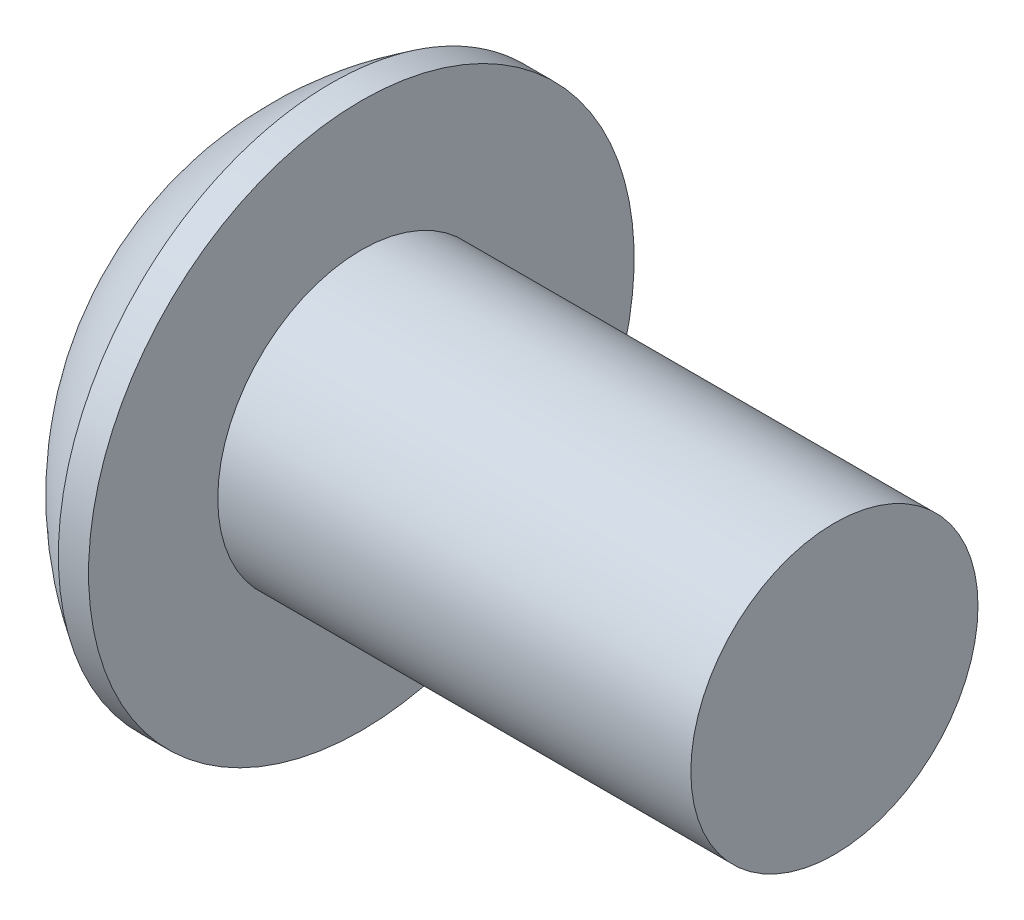
ISO-10303-21;
HEADER;
FILE_DESCRIPTION(('STEP AP214'),'2;1');
FILE_NAME('part.step','',(''),(''),'','','');
FILE_SCHEMA(('AUTOMOTIVE_DESIGN { 1 0 10303 214 1 1 1 1 }'));
ENDSEC;
DATA;
#1=APPLICATION_CONTEXT('core data for automotive mechanical design processes');
#2=APPLICATION_PROTOCOL_DEFINITION('international standard','automotive_design',2000,#1);
#3=PRODUCT_CONTEXT('',#1,'mechanical');
#4=PRODUCT('Part','Part','',(#3));
#5=PRODUCT_RELATED_PRODUCT_CATEGORY('part','',(#4));
#6=PRODUCT_DEFINITION_FORMATION('','',#4);
#7=PRODUCT_DEFINITION_CONTEXT('part definition',#1,'design');
#8=PRODUCT_DEFINITION('design','',#6,#7);
#9=PRODUCT_DEFINITION_SHAPE('','',#8);
#10=(LENGTH_UNIT() NAMED_UNIT(*) SI_UNIT(.MILLI.,.METRE.));
#11=(NAMED_UNIT(*) PLANE_ANGLE_UNIT() SI_UNIT($,.RADIAN.));
#12=(NAMED_UNIT(*) SI_UNIT($,.STERADIAN.) SOLID_ANGLE_UNIT());
#13=UNCERTAINTY_MEASURE_WITH_UNIT(LENGTH_MEASURE(1.E-05),#10,'distance_accuracy_value','');
#14=(GEOMETRIC_REPRESENTATION_CONTEXT(3) GLOBAL_UNCERTAINTY_ASSIGNED_CONTEXT((#13)) GLOBAL_UNIT_ASSIGNED_CONTEXT((#10,
#11,#12)) REPRESENTATION_CONTEXT('',''));
#15=CARTESIAN_POINT('',(0.,0.,0.));
#16=DIRECTION('',(0.,0.,1.));
#17=DIRECTION('',(1.,0.,0.));
#18=AXIS2_PLACEMENT_3D('',#15,#16,#17);
#19=CARTESIAN_POINT('',(-0.533400000000002,0.,0.));
#20=DIRECTION('',(-1.,0.,0.));
#21=DIRECTION('',(0.,0.,1.));
#22=AXIS2_PLACEMENT_3D('',#19,#20,#21);
#23=PLANE('',#22);
#24=DIRECTION('',(0.,0.5,0.866025403784439));
#25=VECTOR('',#24,1.);
#26=CARTESIAN_POINT('',(-0.533400000000002,1.83308710467706,0.));
#27=LINE('',#26,#25);
#28=CARTESIAN_POINT('',(-0.533400000000002,1.83308710467706,0.));
#29=VERTEX_POINT('',#28);
#30=CARTESIAN_POINT('',(-0.533400000000002,0.916543552338531,-1.5875));
#31=VERTEX_POINT('',#30);
#32=EDGE_CURVE('E115',#29,#31,#27,.F.);
#33=ORIENTED_EDGE('',*,*,#32,.T.);
#34=DIRECTION('',(0.,1.,0.));
#35=VECTOR('',#34,1.);
#36=CARTESIAN_POINT('',(-0.533400000000002,0.916543552338531,-1.5875));
#37=LINE('',#36,#35);
#38=CARTESIAN_POINT('',(-0.533400000000002,-0.916543552338531,-1.5875));
#39=VERTEX_POINT('',#38);
#40=EDGE_CURVE('E82',#31,#39,#37,.F.);
#41=ORIENTED_EDGE('',*,*,#40,.T.);
#42=DIRECTION('',(0.,0.5,-0.866025403784439));
#43=VECTOR('',#42,1.);
#44=CARTESIAN_POINT('',(-0.533400000000002,-0.916543552338531,-1.5875));
#45=LINE('',#44,#43);
#46=CARTESIAN_POINT('',(-0.533400000000002,-1.83308710467706,0.));
#47=VERTEX_POINT('',#46);
#48=EDGE_CURVE('E84',#39,#47,#45,.F.);
#49=ORIENTED_EDGE('',*,*,#48,.T.);
#50=DIRECTION('',(0.,-0.5,-0.866025403784439));
#51=VECTOR('',#50,1.);
#52=CARTESIAN_POINT('',(-0.533400000000002,-1.83308710467706,0.));
#53=LINE('',#52,#51);
#54=CARTESIAN_POINT('',(-0.533400000000002,-0.916543552338533,1.5875));
#55=VERTEX_POINT('',#54);
#56=EDGE_CURVE('E85',#47,#55,#53,.F.);
#57=ORIENTED_EDGE('',*,*,#56,.T.);
#58=DIRECTION('',(0.,-1.,0.));
#59=VECTOR('',#58,1.);
#60=CARTESIAN_POINT('',(-0.533400000000002,-0.916543552338532,1.5875));
#61=LINE('',#60,#59);
#62=CARTESIAN_POINT('',(-0.533400000000002,0.916543552338531,1.5875));
#63=VERTEX_POINT('',#62);
#64=EDGE_CURVE('E71',#55,#63,#61,.F.);
#65=ORIENTED_EDGE('',*,*,#64,.T.);
#66=DIRECTION('',(0.,-0.5,0.866025403784439));
#67=VECTOR('',#66,1.);
#68=CARTESIAN_POINT('',(-0.533400000000002,0.916543552338531,1.5875));
#69=LINE('',#68,#67);
#70=EDGE_CURVE('E110',#63,#29,#69,.F.);
#71=ORIENTED_EDGE('',*,*,#70,.T.);
#72=EDGE_LOOP('',(#33,#41,#49,#57,#65,#71));
#73=FACE_BOUND('',#72,.T.);
#74=ADVANCED_FACE('F17',(#73),#23,.T.);
#75=CARTESIAN_POINT('',(-0.533400000000002,-1.83308710467706,0.));
#76=DIRECTION('',(0.,-0.866025403784439,0.5));
#77=DIRECTION('',(0.,-0.5,-0.866025403784439));
#78=AXIS2_PLACEMENT_3D('',#75,#76,#77);
#79=PLANE('',#78);
#80=CARTESIAN_POINT('',(-2.56539999994394,-1.8330871046745,-2.00804498786736E-11));
#81=CARTESIAN_POINT('',(-2.53392818229741,-1.80158505518366,0.0545631502562923));
#82=CARTESIAN_POINT('',(-2.5043050627177,-1.76955629074211,0.110038597579172));
#83=CARTESIAN_POINT('',(-2.45006639539122,-1.70424635317817,0.223158727683824));
#84=CARTESIAN_POINT('',(-2.42548101615987,-1.6709589724711,0.280814162317604));
#85=CARTESIAN_POINT('',(-2.38336609605347,-1.60383660211837,0.397073518091736));
#86=CARTESIAN_POINT('',(-2.36573072948629,-1.57001869730198,0.455647847439699));
#87=CARTESIAN_POINT('',(-2.33856008862263,-1.50163859306838,0.574085662199493));
#88=CARTESIAN_POINT('',(-2.32900454007239,-1.46707848106388,0.633945532106421));
#89=CARTESIAN_POINT('',(-2.32038274183869,-1.40751253669323,0.737116774157155));
#90=CARTESIAN_POINT('',(-2.31910682172836,-1.38258360390154,0.780294952330845));
#91=CARTESIAN_POINT('',(-2.32125913780735,-1.33276652395073,0.866580665890379));
#92=CARTESIAN_POINT('',(-2.32468902284537,-1.30787839414808,0.90968817121394));
#93=CARTESIAN_POINT('',(-2.33605631415915,-1.25834345643267,0.995485200086784));
#94=CARTESIAN_POINT('',(-2.34399762019329,-1.23369687609494,1.03817432946455));
#95=CARTESIAN_POINT('',(-2.36395627681902,-1.18481740842653,1.12283605091316));
#96=CARTESIAN_POINT('',(-2.37597537628367,-1.16058470328902,1.16480832741616));
#97=CARTESIAN_POINT('',(-2.41164383187845,-1.09853862948576,1.27227527965358));
#98=CARTESIAN_POINT('',(-2.43797770752625,-1.06110942924036,1.33710455616529));
#99=CARTESIAN_POINT('',(-2.48243061452926,-1.00607390269188,1.43242888436855));
#100=CARTESIAN_POINT('',(-2.49804835924321,-0.987937988038022,1.46384120999077));
#101=CARTESIAN_POINT('',(-2.53070945051393,-0.951999508520197,1.52608848246242));
#102=CARTESIAN_POINT('',(-2.54775211871235,-0.934196789917587,1.55692369559499));
#103=CARTESIAN_POINT('',(-2.56539999993807,-0.916543552329633,1.58750000001541));
#104=B_SPLINE_CURVE_WITH_KNOTS('',3,(#80,#81,#82,#83,#84,#85,#86,#87,#88,#89,#90,#91,#92,#93,
#94,#95,#96,#97,#98,#99,#100,#101,#102,#103),.UNSPECIFIED.,.F.,.F.,(4,2,2,2,2,2,2,2,2,2,2,4),
(0.,0.211427927732169,0.424087197148228,0.633370156422424,0.842126401515785,0.991537201098734,
1.14100036552056,1.29059292577265,1.44024972414947,1.67781721417335,1.79627069411587,
1.91466809995991),.UNSPECIFIED.);
#105=CARTESIAN_POINT('',(-2.56539999993857,-1.83308710468646,0.));
#106=VERTEX_POINT('',#105);
#107=CARTESIAN_POINT('',(-2.56539999993106,-0.916543552342318,1.5875));
#108=VERTEX_POINT('',#107);
#109=EDGE_CURVE('E20',#106,#108,#104,.T.);
#110=ORIENTED_EDGE('',*,*,#109,.T.);
#111=DIRECTION('',(1.,0.,0.));
#112=VECTOR('',#111,1.);
#113=CARTESIAN_POINT('',(-0.533400000000002,-0.916543552338533,1.5875));
#114=LINE('',#113,#112);
#115=EDGE_CURVE('E90',#108,#55,#114,.T.);
#116=ORIENTED_EDGE('',*,*,#115,.T.);
#117=ORIENTED_EDGE('',*,*,#56,.F.);
#118=DIRECTION('',(1.,0.,0.));
#119=VECTOR('',#118,1.);
#120=CARTESIAN_POINT('',(-0.533400000000002,-1.83308710467706,0.));
#121=LINE('',#120,#119);
#122=EDGE_CURVE('E58',#47,#106,#121,.F.);
#123=ORIENTED_EDGE('',*,*,#122,.T.);
#124=EDGE_LOOP('',(#110,#116,#117,#123));
#125=FACE_BOUND('',#124,.T.);
#126=ADVANCED_FACE('F89',(#125),#79,.F.);
#127=CARTESIAN_POINT('',(-0.533400000000002,-0.916543552338531,-1.5875));
#128=DIRECTION('',(0.,-0.866025403784439,-0.5));
#129=DIRECTION('',(0.,0.5,-0.866025403784439));
#130=AXIS2_PLACEMENT_3D('',#127,#128,#129);
#131=PLANE('',#130);
#132=CARTESIAN_POINT('',(-2.56539999994527,-0.916543552319403,-1.58750000001409));
#133=CARTESIAN_POINT('',(-2.53392818229919,-0.948045601822691,-1.53293684974403));
#134=CARTESIAN_POINT('',(-2.50430506271949,-0.980074366269487,-1.47746140242354));
#135=CARTESIAN_POINT('',(-2.45006639539264,-1.04538430383757,-1.36434127232016));
#136=CARTESIAN_POINT('',(-2.42548101616093,-1.07867168454351,-1.30668583768523));
#137=CARTESIAN_POINT('',(-2.38336609605398,-1.14579405489574,-1.19042648190974));
#138=CARTESIAN_POINT('',(-2.36573072948662,-1.17961195971273,-1.13185215256154));
#139=CARTESIAN_POINT('',(-2.3385600886227,-1.2479920639471,-1.013414337801));
#140=CARTESIAN_POINT('',(-2.32900454007237,-1.28255217595175,-0.953554467893575));
#141=CARTESIAN_POINT('',(-2.32038274183866,-1.34211812032265,-0.850383225842316));
#142=CARTESIAN_POINT('',(-2.31910682172835,-1.36704705311438,-0.807205047668587));
#143=CARTESIAN_POINT('',(-2.32125913780739,-1.41686413306525,-0.720919334108961));
#144=CARTESIAN_POINT('',(-2.32468902284544,-1.44175226286793,-0.67781182878535));
#145=CARTESIAN_POINT('',(-2.33605631415929,-1.49128720058339,-0.592014799912417));
#146=CARTESIAN_POINT('',(-2.34399762019345,-1.51593378092113,-0.54932567053461));
#147=CARTESIAN_POINT('',(-2.36395627681926,-1.56481324858959,-0.464663949085931));
#148=CARTESIAN_POINT('',(-2.37597537628395,-1.58904595372712,-0.422691672582891));
#149=CARTESIAN_POINT('',(-2.41164383187876,-1.65109202753029,-0.315224720345625));
#150=CARTESIAN_POINT('',(-2.43797770752652,-1.6885212277756,-0.250395443834082));
#151=CARTESIAN_POINT('',(-2.48243061452944,-1.74355675432393,-0.15507111563107));
#152=CARTESIAN_POINT('',(-2.49804835924337,-1.76169266897775,-0.123658790008927));
#153=CARTESIAN_POINT('',(-2.53070945051401,-1.79763114849548,-0.0614115175374324));
#154=CARTESIAN_POINT('',(-2.5477521187124,-1.81543386709805,-0.0305763044049344));
#155=CARTESIAN_POINT('',(-2.56539999993807,-1.83308710468596,1.54136844652939E-11));
#156=B_SPLINE_CURVE_WITH_KNOTS('',3,(#132,#133,#134,#135,#136,#137,#138,#139,#140,#141,#142,
#143,#144,#145,#146,#147,#148,#149,#150,#151,#152,#153,#154,#155),.UNSPECIFIED.,.F.,.F.,(4,2,2,
2,2,2,2,2,2,2,2,4),(0.,0.211427927733669,0.424087197151313,0.633370156427101,0.842126401522016,
0.99153720110513,1.14100036552713,1.29059292577937,1.44024972415633,1.67781721417961,
1.79627069412184,1.9146680999656),.UNSPECIFIED.);
#157=CARTESIAN_POINT('',(-2.56539999995198,-0.916543552351339,-1.58750000002218));
#158=VERTEX_POINT('',#157);
#159=EDGE_CURVE('E94',#158,#106,#156,.T.);
#160=ORIENTED_EDGE('',*,*,#159,.T.);
#161=ORIENTED_EDGE('',*,*,#122,.F.);
#162=ORIENTED_EDGE('',*,*,#48,.F.);
#163=DIRECTION('',(-1.,0.,0.));
#164=VECTOR('',#163,1.);
#165=CARTESIAN_POINT('',(-0.533400000000002,-0.916543552338531,-1.5875));
#166=LINE('',#165,#164);
#167=EDGE_CURVE('E96',#39,#158,#166,.T.);
#168=ORIENTED_EDGE('',*,*,#167,.T.);
#169=EDGE_LOOP('',(#160,#161,#162,#168));
#170=FACE_BOUND('',#169,.T.);
#171=ADVANCED_FACE('F92',(#170),#131,.F.);
#172=CARTESIAN_POINT('',(-0.533400000000002,0.916543552338531,-1.5875));
#173=DIRECTION('',(0.,0.,-1.));
#174=DIRECTION('',(-1.,0.,0.));
#175=AXIS2_PLACEMENT_3D('',#172,#173,#174);
#176=PLANE('',#175);
#177=CARTESIAN_POINT('',(-2.56539999994527,0.916543552360294,-1.58749999999048));
#178=CARTESIAN_POINT('',(-2.53392818229821,0.853539453376781,-1.58749999999657));
#179=CARTESIAN_POINT('',(-2.50430506271702,0.789481924500113,-1.58749999999908));
#180=CARTESIAN_POINT('',(-2.45006639538581,0.658862049392287,-1.58750000000093));
#181=CARTESIAN_POINT('',(-2.42548101615122,0.59228728799181,-1.58750000000025));
#182=CARTESIAN_POINT('',(-2.38336609603683,0.458042547310979,-1.58749999999976));
#183=CARTESIAN_POINT('',(-2.36573072946494,0.390406737689213,-1.58749999999994));
#184=CARTESIAN_POINT('',(-2.3385600885904,0.253646529243895,-1.58750000000006));
#185=CARTESIAN_POINT('',(-2.32900454003397,0.184526305245804,-1.58750000000001));
#186=CARTESIAN_POINT('',(-2.32038274178942,0.0653944165301613,-1.58749999999999));
#187=CARTESIAN_POINT('',(-2.31910682167392,0.0155365509618711,-1.5875));
#188=CARTESIAN_POINT('',(-2.3212591377409,-0.0840976089101244,-1.5875));
#189=CARTESIAN_POINT('',(-2.32468902277208,-0.133873868500894,-1.5875));
#190=CARTESIAN_POINT('',(-2.33605631407098,-0.2329437439033,-1.5875));
#191=CARTESIAN_POINT('',(-2.34399762009707,-0.282236904564879,-1.5875));
#192=CARTESIAN_POINT('',(-2.36395627670599,-0.379995839874564,-1.5875));
#193=CARTESIAN_POINT('',(-2.37597537616188,-0.428461250136325,-1.5875));
#194=CARTESIAN_POINT('',(-2.41164383175616,-0.552553397787632,-1.5875));
#195=CARTESIAN_POINT('',(-2.43797770742117,-0.627411798334259,-1.5875));
#196=CARTESIAN_POINT('',(-2.48243061445881,-0.737482851511091,-1.5875));
#197=CARTESIAN_POINT('',(-2.49804835918582,-0.773754680844889,-1.5875));
#198=CARTESIAN_POINT('',(-2.53070945048496,-0.845631639931401,-1.5875));
#199=CARTESIAN_POINT('',(-2.54775211869874,-0.881237077161412,-1.5875));
#200=CARTESIAN_POINT('',(-2.56539999994071,-0.916543552361606,-1.5875));
#201=B_SPLINE_CURVE_WITH_KNOTS('',3,(#177,#178,#179,#180,#181,#182,#183,#184,#185,#186,#187,
#188,#189,#190,#191,#192,#193,#194,#195,#196,#197,#198,#199,#200),.UNSPECIFIED.,.F.,.F.,(4,2,2,
2,2,2,2,2,2,2,2,4),(0.,0.211427927701375,0.424087197086717,0.633370156331471,0.842126401395377,
0.991537200933545,1.14100036531054,1.29059292551773,1.44024972384963,1.677817214047,
1.79627069407681,1.91466810000777),.UNSPECIFIED.);
#202=CARTESIAN_POINT('',(-2.56539999995198,0.916543552337129,-1.58749999999757));
#203=VERTEX_POINT('',#202);
#204=EDGE_CURVE('E198',#203,#158,#201,.T.);
#205=ORIENTED_EDGE('',*,*,#204,.T.);
#206=ORIENTED_EDGE('',*,*,#167,.F.);
#207=ORIENTED_EDGE('',*,*,#40,.F.);
#208=DIRECTION('',(1.,0.,0.));
#209=VECTOR('',#208,1.);
#210=CARTESIAN_POINT('',(-0.533400000000002,0.916543552338531,-1.5875));
#211=LINE('',#210,#209);
#212=EDGE_CURVE('E112',#31,#203,#211,.F.);
#213=ORIENTED_EDGE('',*,*,#212,.T.);
#214=EDGE_LOOP('',(#205,#206,#207,#213));
#215=FACE_BOUND('',#214,.T.);
#216=ADVANCED_FACE('F188',(#215),#176,.F.);
#217=CARTESIAN_POINT('',(-0.533400000000002,1.83308710467706,0.));
#218=DIRECTION('',(0.,0.866025403784439,-0.5));
#219=DIRECTION('',(0.,0.5,0.866025403784439));
#220=AXIS2_PLACEMENT_3D('',#217,#218,#219);
#221=PLANE('',#220);
#222=CARTESIAN_POINT('',(-2.56539999994394,1.8330871046745,2.00800374309997E-11));
#223=CARTESIAN_POINT('',(-2.5339281822974,1.80158505518366,-0.0545631502562965));
#224=CARTESIAN_POINT('',(-2.5043050627177,1.76955629074211,-0.11003859757918));
#225=CARTESIAN_POINT('',(-2.45006639539121,1.70424635317816,-0.22315872768384));
#226=CARTESIAN_POINT('',(-2.42548101615987,1.67095897247109,-0.280814162317626));
#227=CARTESIAN_POINT('',(-2.38336609605347,1.60383660211835,-0.397073518091758));
#228=CARTESIAN_POINT('',(-2.36573072948628,1.57001869730197,-0.455647847439717));
#229=CARTESIAN_POINT('',(-2.33856008862263,1.50163859306837,-0.574085662199503));
#230=CARTESIAN_POINT('',(-2.32900454007239,1.46707848106388,-0.633945532106426));
#231=CARTESIAN_POINT('',(-2.32038274183869,1.40751253669322,-0.737116774157154));
#232=CARTESIAN_POINT('',(-2.31910682172836,1.38258360390154,-0.780294952330843));
#233=CARTESIAN_POINT('',(-2.32125913780735,1.33276652395073,-0.866580665890374));
#234=CARTESIAN_POINT('',(-2.32468902284537,1.30787839414808,-0.909688171213933));
#235=CARTESIAN_POINT('',(-2.33605631415915,1.25834345643267,-0.995485200086777));
#236=CARTESIAN_POINT('',(-2.34399762019328,1.23369687609495,-1.03817432946455));
#237=CARTESIAN_POINT('',(-2.36395627681902,1.18481740842653,-1.12283605091316));
#238=CARTESIAN_POINT('',(-2.37597537628367,1.16058470328902,-1.16480832741616));
#239=CARTESIAN_POINT('',(-2.41164383187872,1.09853862948529,-1.2722752796544));
#240=CARTESIAN_POINT('',(-2.43797770752691,1.06110942923942,-1.33710455616691));
#241=CARTESIAN_POINT('',(-2.48243061453059,1.00607390269029,-1.43242888437131));
#242=CARTESIAN_POINT('',(-2.49804835924479,0.987937988036214,-1.4638412099939));
#243=CARTESIAN_POINT('',(-2.53070945051602,0.951999508517968,-1.52608848246628));
#244=CARTESIAN_POINT('',(-2.54775211871471,0.934196789915152,-1.55692369559921));
#245=CARTESIAN_POINT('',(-2.56539999994071,0.916543552326994,-1.58750000001998));
#246=B_SPLINE_CURVE_WITH_KNOTS('',3,(#222,#223,#224,#225,#226,#227,#228,#229,#230,#231,#232,
#233,#234,#235,#236,#237,#238,#239,#240,#241,#242,#243,#244,#245),.UNSPECIFIED.,.F.,.F.,(4,2,2,
2,2,2,2,2,2,2,2,4),(0.,0.211427927732185,0.424087197148259,0.63337015642244,0.842126401515786,
0.99153720109873,1.14100036552055,1.29059292577265,1.44024972414947,1.67781721417631,
1.7962706941203,1.9146680999658),.UNSPECIFIED.);
#247=CARTESIAN_POINT('',(-2.56539999993857,1.83308710468646,0.));
#248=VERTEX_POINT('',#247);
#249=EDGE_CURVE('E192',#248,#203,#246,.T.);
#250=ORIENTED_EDGE('',*,*,#249,.T.);
#251=ORIENTED_EDGE('',*,*,#212,.F.);
#252=ORIENTED_EDGE('',*,*,#32,.F.);
#253=DIRECTION('',(1.,0.,0.));
#254=VECTOR('',#253,1.);
#255=CARTESIAN_POINT('',(-0.533400000000002,1.83308710467706,0.));
#256=LINE('',#255,#254);
#257=EDGE_CURVE('E107',#29,#248,#256,.F.);
#258=ORIENTED_EDGE('',*,*,#257,.T.);
#259=EDGE_LOOP('',(#250,#251,#252,#258));
#260=FACE_BOUND('',#259,.T.);
#261=ADVANCED_FACE('F184',(#260),#221,.F.);
#262=CARTESIAN_POINT('',(-0.533400000000002,0.916543552338531,1.5875));
#263=DIRECTION('',(0.,0.866025403784439,0.5));
#264=DIRECTION('',(0.,-0.5,0.866025403784439));
#265=AXIS2_PLACEMENT_3D('',#262,#263,#264);
#266=PLANE('',#265);
#267=CARTESIAN_POINT('',(-2.56539999994394,0.91654355231986,1.58750000000782));
#268=CARTESIAN_POINT('',(-2.53392818229741,0.948045601824288,1.5329368497393));
#269=CARTESIAN_POINT('',(-2.5043050627177,0.980074366271431,1.47746140241964));
#270=CARTESIAN_POINT('',(-2.45006639539122,1.04538430383949,1.36434127231737));
#271=CARTESIAN_POINT('',(-2.42548101615987,1.07867168454504,1.30668583768271));
#272=CARTESIAN_POINT('',(-2.38336609605347,1.14579405489669,1.19042648190795));
#273=CARTESIAN_POINT('',(-2.36573072948629,1.17961195971347,1.13185215256022));
#274=CARTESIAN_POINT('',(-2.33856008862263,1.24799206394736,1.01341433780059));
#275=CARTESIAN_POINT('',(-2.32900454007239,1.28255217595174,0.953554467893597));
#276=CARTESIAN_POINT('',(-2.32038274183869,1.34211812032234,0.850383225842832));
#277=CARTESIAN_POINT('',(-2.31910682172836,1.36704705311405,0.807205047669152));
#278=CARTESIAN_POINT('',(-2.32125913780735,1.41686413306487,0.720919334109624));
#279=CARTESIAN_POINT('',(-2.32468902284537,1.44175226286752,0.677811828786061));
#280=CARTESIAN_POINT('',(-2.33605631415915,1.49128720058292,0.592014799913215));
#281=CARTESIAN_POINT('',(-2.34399762019328,1.51593378092065,0.549325670535446));
#282=CARTESIAN_POINT('',(-2.36395627681902,1.56481324858906,0.464663949086841));
#283=CARTESIAN_POINT('',(-2.37597537628367,1.58904595372657,0.422691672583837));
#284=CARTESIAN_POINT('',(-2.41164383187845,1.65109202752983,0.315224720346425));
#285=CARTESIAN_POINT('',(-2.43797770752625,1.68852122777524,0.250395443834706));
#286=CARTESIAN_POINT('',(-2.48243061452926,1.74355675432371,0.155071115631445));
#287=CARTESIAN_POINT('',(-2.49804835924321,1.76169266897757,0.123658790009225));
#288=CARTESIAN_POINT('',(-2.53070945051393,1.7976311484954,0.0614115175375789));
#289=CARTESIAN_POINT('',(-2.54775211871235,1.81543386709801,0.0305763044050067));
#290=CARTESIAN_POINT('',(-2.56539999993807,1.83308710468596,-1.54142580803093E-11));
#291=B_SPLINE_CURVE_WITH_KNOTS('',3,(#267,#268,#269,#270,#271,#272,#273,#274,#275,#276,#277,
#278,#279,#280,#281,#282,#283,#284,#285,#286,#287,#288,#289,#290),.UNSPECIFIED.,.F.,.F.,(4,2,2,
2,2,2,2,2,2,2,2,4),(0.,0.211427927732169,0.424087197148227,0.633370156422423,0.842126401515785,
0.991537201098733,1.14100036552056,1.29059292577265,1.44024972414946,1.67781721417335,
1.79627069411587,1.91466809995991),.UNSPECIFIED.);
#292=CARTESIAN_POINT('',(-2.56539999993857,0.91654355234323,1.58750000000814));
#293=VERTEX_POINT('',#292);
#294=EDGE_CURVE('E166',#293,#248,#291,.T.);
#295=ORIENTED_EDGE('',*,*,#294,.T.);
#296=ORIENTED_EDGE('',*,*,#257,.F.);
#297=ORIENTED_EDGE('',*,*,#70,.F.);
#298=DIRECTION('',(1.,0.,0.));
#299=VECTOR('',#298,1.);
#300=CARTESIAN_POINT('',(-0.533400000000002,0.916543552338531,1.5875));
#301=LINE('',#300,#299);
#302=EDGE_CURVE('E39',#63,#293,#301,.F.);
#303=ORIENTED_EDGE('',*,*,#302,.T.);
#304=EDGE_LOOP('',(#295,#296,#297,#303));
#305=FACE_BOUND('',#304,.T.);
#306=ADVANCED_FACE('F177',(#305),#266,.F.);
#307=CARTESIAN_POINT('',(-0.533400000000002,-0.916543552338532,1.5875));
#308=DIRECTION('',(0.,0.,1.));
#309=DIRECTION('',(0.,-1.,0.));
#310=AXIS2_PLACEMENT_3D('',#307,#308,#309);
#311=PLANE('',#310);
#312=CARTESIAN_POINT('',(-2.56539999994394,-0.916543552354642,1.58749999998774));
#313=CARTESIAN_POINT('',(-2.53392818229741,-0.853539453359365,1.58749999999559));
#314=CARTESIAN_POINT('',(-2.50430506271771,-0.789481924470656,1.58749999999882));
#315=CARTESIAN_POINT('',(-2.45006639539122,-0.658862049338629,1.58750000000119));
#316=CARTESIAN_POINT('',(-2.42548101615988,-0.592287287925995,1.58750000000032));
#317=CARTESIAN_POINT('',(-2.38336609605349,-0.458042547221593,1.58749999999969));
#318=CARTESIAN_POINT('',(-2.36573072948631,-0.390406737588416,1.58749999999992));
#319=CARTESIAN_POINT('',(-2.33856008862266,-0.253646529120892,1.58750000000008));
#320=CARTESIAN_POINT('',(-2.32900454007243,-0.184526305112002,1.58750000000002));
#321=CARTESIAN_POINT('',(-2.32038274183874,-0.065394416370719,1.58749999999999));
#322=CARTESIAN_POINT('',(-2.31910682172841,-0.0155365507873145,1.5875));
#323=CARTESIAN_POINT('',(-2.32125913780742,0.0840976091143436,1.5875));
#324=CARTESIAN_POINT('',(-2.32468902284545,0.133873868719661,1.5875));
#325=CARTESIAN_POINT('',(-2.33605631415924,0.232943744150505,1.5875));
#326=CARTESIAN_POINT('',(-2.34399762019338,0.282236904825971,1.5875));
#327=CARTESIAN_POINT('',(-2.36395627681913,0.379995840162817,1.5875));
#328=CARTESIAN_POINT('',(-2.37597537628379,0.428461250437852,1.5875));
#329=CARTESIAN_POINT('',(-2.41164383187857,0.552553398044325,1.5875));
#330=CARTESIAN_POINT('',(-2.43797770752636,0.627411798535089,1.5875));
#331=CARTESIAN_POINT('',(-2.48243061452933,0.737482851631955,1.5875));
#332=CARTESIAN_POINT('',(-2.49804835924327,0.773754680939651,1.5875));
#333=CARTESIAN_POINT('',(-2.53070945051396,0.84563163997525,1.5875));
#334=CARTESIAN_POINT('',(-2.54775211871237,0.881237077180446,1.5875));
#335=CARTESIAN_POINT('',(-2.56539999993807,0.91654355235633,1.5875));
#336=B_SPLINE_CURVE_WITH_KNOTS('',3,(#312,#313,#314,#315,#316,#317,#318,#319,#320,#321,#322,
#323,#324,#325,#326,#327,#328,#329,#330,#331,#332,#333,#334,#335),.UNSPECIFIED.,.F.,.F.,(4,2,2,
2,2,2,2,2,2,2,2,4),(0.,0.211427927732202,0.424087197148294,0.633370156422521,0.842126401515914,
0.991537201098908,1.14100036552078,1.29059292577292,1.44024972414978,1.67781721417349,
1.79627069411592,1.91466809995988),.UNSPECIFIED.);
#337=EDGE_CURVE('E158',#108,#293,#336,.T.);
#338=ORIENTED_EDGE('',*,*,#337,.T.);
#339=ORIENTED_EDGE('',*,*,#302,.F.);
#340=ORIENTED_EDGE('',*,*,#64,.F.);
#341=ORIENTED_EDGE('',*,*,#115,.F.);
#342=EDGE_LOOP('',(#338,#339,#340,#341));
#343=FACE_BOUND('',#342,.T.);
#344=ADVANCED_FACE('F173',(#343),#311,.F.);
#345=CARTESIAN_POINT('',(-2.56540000003724,0.,0.));
#346=DIRECTION('',(-1.,0.,0.));
#347=DIRECTION('',(0.,-1.,0.));
#348=AXIS2_PLACEMENT_3D('',#345,#346,#347);
#349=CONICAL_SURFACE('',#348,1.83308710478514,0.78539816351237);
#350=ORIENTED_EDGE('',*,*,#109,.F.);
#351=CARTESIAN_POINT('',(-2.56539999992356,0.,0.));
#352=DIRECTION('',(-1.,0.,0.));
#353=DIRECTION('',(0.,-1.,0.));
#354=AXIS2_PLACEMENT_3D('',#351,#352,#353);
#355=CIRCLE('',#354,1.83308710467145);
#356=EDGE_CURVE('E165',#108,#106,#355,.F.);
#357=ORIENTED_EDGE('',*,*,#356,.F.);
#358=EDGE_LOOP('',(#350,#357));
#359=FACE_BOUND('',#358,.T.);
#360=ADVANCED_FACE('F176',(#359),#349,.F.);
#361=CARTESIAN_POINT('',(-2.56540000003724,0.,0.));
#362=DIRECTION('',(-1.,0.,0.));
#363=DIRECTION('',(0.,-1.,0.));
#364=AXIS2_PLACEMENT_3D('',#361,#362,#363);
#365=CONICAL_SURFACE('',#364,1.83308710478514,0.78539816351237);
#366=ORIENTED_EDGE('',*,*,#159,.F.);
#367=CARTESIAN_POINT('',(-2.56539999992356,0.,0.));
#368=DIRECTION('',(-1.,0.,0.));
#369=DIRECTION('',(0.,-1.,0.));
#370=AXIS2_PLACEMENT_3D('',#367,#368,#369);
#371=CIRCLE('',#370,1.83308710467145);
#372=EDGE_CURVE('E273',#106,#158,#371,.F.);
#373=ORIENTED_EDGE('',*,*,#372,.F.);
#374=EDGE_LOOP('',(#366,#373));
#375=FACE_BOUND('',#374,.T.);
#376=ADVANCED_FACE('F210',(#375),#365,.F.);
#377=CARTESIAN_POINT('',(-2.56540000003724,0.,0.));
#378=DIRECTION('',(-1.,0.,0.));
#379=DIRECTION('',(0.,-1.,0.));
#380=AXIS2_PLACEMENT_3D('',#377,#378,#379);
#381=CONICAL_SURFACE('',#380,1.83308710478514,0.785398163397448);
#382=ORIENTED_EDGE('',*,*,#204,.F.);
#383=CARTESIAN_POINT('',(-2.5653999999804,0.,0.));
#384=DIRECTION('',(-1.,0.,0.));
#385=DIRECTION('',(0.,-1.,0.));
#386=AXIS2_PLACEMENT_3D('',#383,#384,#385);
#387=CIRCLE('',#386,1.83308710472829);
#388=EDGE_CURVE('E270',#158,#203,#387,.F.);
#389=ORIENTED_EDGE('',*,*,#388,.F.);
#390=EDGE_LOOP('',(#382,#389));
#391=FACE_BOUND('',#390,.T.);
#392=ADVANCED_FACE('F206',(#391),#381,.F.);
#393=CARTESIAN_POINT('',(-2.56540000003724,0.,0.));
#394=DIRECTION('',(-1.,0.,0.));
#395=DIRECTION('',(0.,-1.,0.));
#396=AXIS2_PLACEMENT_3D('',#393,#394,#395);
#397=CONICAL_SURFACE('',#396,1.83308710478514,0.78539816351237);
#398=ORIENTED_EDGE('',*,*,#249,.F.);
#399=CARTESIAN_POINT('',(-2.56539999992356,0.,0.));
#400=DIRECTION('',(-1.,0.,0.));
#401=DIRECTION('',(0.,-1.,0.));
#402=AXIS2_PLACEMENT_3D('',#399,#400,#401);
#403=CIRCLE('',#402,1.83308710467145);
#404=EDGE_CURVE('E267',#203,#248,#403,.F.);
#405=ORIENTED_EDGE('',*,*,#404,.F.);
#406=EDGE_LOOP('',(#398,#405));
#407=FACE_BOUND('',#406,.T.);
#408=ADVANCED_FACE('F203',(#407),#397,.F.);
#409=CARTESIAN_POINT('',(-2.56540000003724,0.,0.));
#410=DIRECTION('',(-1.,0.,0.));
#411=DIRECTION('',(0.,-1.,0.));
#412=AXIS2_PLACEMENT_3D('',#409,#410,#411);
#413=CONICAL_SURFACE('',#412,1.83308710478514,0.78539816351237);
#414=ORIENTED_EDGE('',*,*,#294,.F.);
#415=CARTESIAN_POINT('',(-2.56539999992356,0.,0.));
#416=DIRECTION('',(-1.,0.,0.));
#417=DIRECTION('',(0.,-1.,0.));
#418=AXIS2_PLACEMENT_3D('',#415,#416,#417);
#419=CIRCLE('',#418,1.83308710467145);
#420=EDGE_CURVE('E262',#248,#293,#419,.F.);
#421=ORIENTED_EDGE('',*,*,#420,.F.);
#422=EDGE_LOOP('',(#414,#421));
#423=FACE_BOUND('',#422,.T.);
#424=ADVANCED_FACE('F153',(#423),#413,.F.);
#425=CARTESIAN_POINT('',(-2.56540000003724,0.,0.));
#426=DIRECTION('',(-1.,0.,0.));
#427=DIRECTION('',(0.,-1.,0.));
#428=AXIS2_PLACEMENT_3D('',#425,#426,#427);
#429=CONICAL_SURFACE('',#428,1.83308710478514,0.785398163512485);
#430=ORIENTED_EDGE('',*,*,#337,.F.);
#431=CARTESIAN_POINT('',(-2.56539999992356,0.,0.));
#432=DIRECTION('',(-1.,0.,0.));
#433=DIRECTION('',(0.,-1.,0.));
#434=AXIS2_PLACEMENT_3D('',#431,#432,#433);
#435=CIRCLE('',#434,1.83308710467145);
#436=EDGE_CURVE('E138',#293,#108,#435,.F.);
#437=ORIENTED_EDGE('',*,*,#436,.F.);
#438=EDGE_LOOP('',(#430,#437));
#439=FACE_BOUND('',#438,.T.);
#440=ADVANCED_FACE('F148',(#439),#429,.F.);
#441=CARTESIAN_POINT('',(-2.5654,0.,0.));
#442=DIRECTION('',(-1.,0.,0.));
#443=DIRECTION('',(0.,-1.,0.));
#444=AXIS2_PLACEMENT_3D('',#441,#442,#443);
#445=PLANE('',#444);
#446=CARTESIAN_POINT('',(-2.5654,-2.29235000000002,0.));
#447=CARTESIAN_POINT('',(-2.56540000000001,-2.29234961429958,-0.0643619991867162));
#448=CARTESIAN_POINT('',(-2.56540000000002,-2.28963695190109,-0.128735826629366));
#449=CARTESIAN_POINT('',(-2.56539999999999,-2.27880393843649,-0.257038618985287));
#450=CARTESIAN_POINT('',(-2.56539999999995,-2.27068199085128,-0.320967446929163));
#451=CARTESIAN_POINT('',(-2.56540000000006,-2.24906694794257,-0.448021254607718));
#452=CARTESIAN_POINT('',(-2.56540000000021,-2.23556532653462,-0.511144793381861));
#453=CARTESIAN_POINT('',(-2.56539999999979,-2.20328400495645,-0.636065176149322));
#454=CARTESIAN_POINT('',(-2.56539999999921,-2.18450002159115,-0.697860899533935));
#455=CARTESIAN_POINT('',(-2.56539999999869,-2.12048422735804,-0.88032980292775));
#456=CARTESIAN_POINT('',(-2.56539999999995,-2.0675359907946,-0.99839179592812));
#457=CARTESIAN_POINT('',(-2.56540000000006,-1.94254204858674,-1.22393765942148));
#458=CARTESIAN_POINT('',(-2.56539999999891,-1.87049561696644,-1.33142112758208));
#459=CARTESIAN_POINT('',(-2.56539999999932,-1.74974254194881,-1.48237719670935));
#460=CARTESIAN_POINT('',(-2.56539999999982,-1.70734573132302,-1.53101280076738));
#461=CARTESIAN_POINT('',(-2.56540000000018,-1.6186391029153,-1.62450601319185));
#462=CARTESIAN_POINT('',(-2.56540000000005,-1.57233309727313,-1.66936721890417));
#463=CARTESIAN_POINT('',(-2.56539999999995,-1.47608431707234,-1.7550488420402));
#464=CARTESIAN_POINT('',(-2.56539999999999,-1.42613990458995,-1.79586741981512));
#465=CARTESIAN_POINT('',(-2.56540000000002,-1.32299452541252,-1.87315615311523));
#466=CARTESIAN_POINT('',(-2.56540000000001,-1.26979280714188,-1.90962529930697));
#467=CARTESIAN_POINT('',(-2.56539999999999,-1.10588180153953,-2.0120772215109));
#468=CARTESIAN_POINT('',(-2.5654,-0.990764947001321,-2.07119486286667));
#469=CARTESIAN_POINT('',(-2.5654,-0.752302198839727,-2.16922858468856));
#470=CARTESIAN_POINT('',(-2.5654,-0.628956393121269,-2.2081448809145));
#471=CARTESIAN_POINT('',(-2.5654,-0.377466101733277,-2.2647275576592));
#472=CARTESIAN_POINT('',(-2.5654,-0.249321590440388,-2.28239382469379));
#473=CARTESIAN_POINT('',(-2.5654,0.0081143537161001,-2.29595665980956));
#474=CARTESIAN_POINT('',(-2.5654,0.137405786579698,-2.29185322789073));
#475=CARTESIAN_POINT('',(-2.5654,0.393449386933719,-2.2620096240906));
#476=CARTESIAN_POINT('',(-2.5654,0.520201567981077,-2.23626956775766));
#477=CARTESIAN_POINT('',(-2.5654,0.767645294384444,-2.16383549332687));
#478=CARTESIAN_POINT('',(-2.5654,0.888336774993549,-2.11714125142686));
#479=CARTESIAN_POINT('',(-2.5654,1.06210572146655,-2.03247976453654));
#480=CARTESIAN_POINT('',(-2.5654,1.11884498714066,-2.00180278323696));
#481=CARTESIAN_POINT('',(-2.5654,1.22954062855572,-1.93578011658036));
#482=CARTESIAN_POINT('',(-2.5654,1.28349764565392,-1.9004355139425));
#483=CARTESIAN_POINT('',(-2.5654,1.38821676641537,-1.82534174602348));
#484=CARTESIAN_POINT('',(-2.5654,1.43898030563028,-1.78559458231503));
#485=CARTESIAN_POINT('',(-2.5654,1.53701984534431,-1.70193996292362));
#486=CARTESIAN_POINT('',(-2.5654,1.5842924328055,-1.65802852924127));
#487=CARTESIAN_POINT('',(-2.5654,1.72023903553758,-1.52059650554139));
#488=CARTESIAN_POINT('',(-2.5654,1.80318066138239,-1.42127847626519));
#489=CARTESIAN_POINT('',(-2.5654,1.95118232345098,-1.21011519784664));
#490=CARTESIAN_POINT('',(-2.5654,2.01624303935584,-1.09827042509272));
#491=CARTESIAN_POINT('',(-2.5654,2.09907772661314,-0.923538238005839));
#492=CARTESIAN_POINT('',(-2.5654,2.12425103063558,-0.864058373981966));
#493=CARTESIAN_POINT('',(-2.5654,2.16947990046565,-0.743221562175601));
#494=CARTESIAN_POINT('',(-2.5654,2.18953960800684,-0.681866178863365));
#495=CARTESIAN_POINT('',(-2.5654,2.22438542051156,-0.557786972400356));
#496=CARTESIAN_POINT('',(-2.5654,2.23917985294818,-0.495065478128172));
#497=CARTESIAN_POINT('',(-2.5654,2.26343456384453,-0.368611258323514));
#498=CARTESIAN_POINT('',(-2.5654,2.27289641559285,-0.304878836759566));
#499=CARTESIAN_POINT('',(-2.5654,2.28388649696736,-0.200873029360621));
#500=CARTESIAN_POINT('',(-2.5654,2.28705930623293,-0.160766164180096));
#501=CARTESIAN_POINT('',(-2.5654,2.29129117827044,-0.0804410725432706));
#502=CARTESIAN_POINT('',(-2.5654,2.29235024104238,-0.0402228460869715));
#503=CARTESIAN_POINT('',(-2.56540000000001,2.29234961429956,0.0643619991867166));
#504=CARTESIAN_POINT('',(-2.56540000000002,2.28963695190107,0.128735826629366));
#505=CARTESIAN_POINT('',(-2.56539999999999,2.27880393843648,0.257038618985288));
#506=CARTESIAN_POINT('',(-2.56539999999995,2.27068199085126,0.320967446929163));
#507=CARTESIAN_POINT('',(-2.56540000000006,2.24906694794255,0.448021254607719));
#508=CARTESIAN_POINT('',(-2.56540000000021,2.2355653265346,0.511144793381862));
#509=CARTESIAN_POINT('',(-2.56539999999979,2.20328400495644,0.636065176149322));
#510=CARTESIAN_POINT('',(-2.56539999999921,2.18450002159113,0.697860899533936));
#511=CARTESIAN_POINT('',(-2.56539999999869,2.12048422735802,0.88032980292775));
#512=CARTESIAN_POINT('',(-2.56539999999995,2.06753599079459,0.998391795928119));
#513=CARTESIAN_POINT('',(-2.56540000000006,1.94254204858672,1.22393765942147));
#514=CARTESIAN_POINT('',(-2.56539999999891,1.87049561696642,1.33142112758208));
#515=CARTESIAN_POINT('',(-2.56539999999933,1.7497425419488,1.48237719670935));
#516=CARTESIAN_POINT('',(-2.56539999999982,1.707345731323,1.53101280076738));
#517=CARTESIAN_POINT('',(-2.56540000000018,1.61863910291529,1.62450601319185));
#518=CARTESIAN_POINT('',(-2.56540000000005,1.57233309727312,1.66936721890418));
#519=CARTESIAN_POINT('',(-2.56539999999995,1.47608431707233,1.75504884204021));
#520=CARTESIAN_POINT('',(-2.56539999999999,1.42613990458993,1.79586741981512));
#521=CARTESIAN_POINT('',(-2.56540000000002,1.3229945254125,1.87315615311523));
#522=CARTESIAN_POINT('',(-2.56540000000001,1.26979280714187,1.90962529930697));
#523=CARTESIAN_POINT('',(-2.56539999999999,1.10588180153952,2.0120772215109));
#524=CARTESIAN_POINT('',(-2.5654,0.990764947001304,2.07119486286667));
#525=CARTESIAN_POINT('',(-2.5654,0.75230219883971,2.16922858468856));
#526=CARTESIAN_POINT('',(-2.5654,0.628956393121252,2.2081448809145));
#527=CARTESIAN_POINT('',(-2.5654,0.377466101733262,2.2647275576592));
#528=CARTESIAN_POINT('',(-2.5654,0.249321590440372,2.28239382469379));
#529=CARTESIAN_POINT('',(-2.5654,-0.00811435371611611,2.29595665980955));
#530=CARTESIAN_POINT('',(-2.5654,-0.137405786579714,2.29185322789072));
#531=CARTESIAN_POINT('',(-2.5654,-0.393449386933735,2.2620096240906));
#532=CARTESIAN_POINT('',(-2.5654,-0.520201567981094,2.23626956775766));
#533=CARTESIAN_POINT('',(-2.5654,-0.767645294384462,2.16383549332688));
#534=CARTESIAN_POINT('',(-2.5654,-0.888336774993567,2.11714125142686));
#535=CARTESIAN_POINT('',(-2.5654,-1.06210572146657,2.03247976453654));
#536=CARTESIAN_POINT('',(-2.5654,-1.11884498714068,2.00180278323695));
#537=CARTESIAN_POINT('',(-2.5654,-1.22954062855574,1.93578011658036));
#538=CARTESIAN_POINT('',(-2.5654,-1.28349764565394,1.9004355139425));
#539=CARTESIAN_POINT('',(-2.5654,-1.38821676641539,1.82534174602348));
#540=CARTESIAN_POINT('',(-2.5654,-1.4389803056303,1.78559458231503));
#541=CARTESIAN_POINT('',(-2.5654,-1.53701984534432,1.70193996292362));
#542=CARTESIAN_POINT('',(-2.5654,-1.58429243280552,1.65802852924127));
#543=CARTESIAN_POINT('',(-2.5654,-1.7202390355376,1.52059650554139));
#544=CARTESIAN_POINT('',(-2.5654,-1.8031806613824,1.42127847626519));
#545=CARTESIAN_POINT('',(-2.5654,-1.951182323451,1.21011519784664));
#546=CARTESIAN_POINT('',(-2.5654,-2.01624303935586,1.09827042509272));
#547=CARTESIAN_POINT('',(-2.5654,-2.09907772661316,0.923538238005837));
#548=CARTESIAN_POINT('',(-2.5654,-2.1242510306356,0.864058373981964));
#549=CARTESIAN_POINT('',(-2.5654,-2.16947990046567,0.743221562175599));
#550=CARTESIAN_POINT('',(-2.5654,-2.18953960800686,0.681866178863365));
#551=CARTESIAN_POINT('',(-2.5654,-2.22438542051158,0.557786972400357));
#552=CARTESIAN_POINT('',(-2.5654,-2.2391798529482,0.495065478128172));
#553=CARTESIAN_POINT('',(-2.5654,-2.26343456384455,0.368611258323514));
#554=CARTESIAN_POINT('',(-2.5654,-2.27289641559287,0.304878836759567));
#555=CARTESIAN_POINT('',(-2.5654,-2.28388649696738,0.200873029360623));
#556=CARTESIAN_POINT('',(-2.5654,-2.28705930623295,0.160766164180096));
#557=CARTESIAN_POINT('',(-2.5654,-2.29129117827046,0.080441072543271));
#558=CARTESIAN_POINT('',(-2.5654,-2.29235024104239,0.0402228460869719));
#559=CARTESIAN_POINT('',(-2.5654,-2.29235000000002,0.));
#560=B_SPLINE_CURVE_WITH_KNOTS('',3,(#446,#447,#448,#449,#450,#451,#452,#453,#454,#455,#456,
#457,#458,#459,#460,#461,#462,#463,#464,#465,#466,#467,#468,#469,#470,#471,#472,#473,#474,#475,
#476,#477,#478,#479,#480,#481,#482,#483,#484,#485,#486,#487,#488,#489,#490,#491,#492,#493,#494,
#495,#496,#497,#498,#499,#500,#501,#502,#503,#504,#505,#506,#507,#508,#509,#510,#511,#512,#513,
#514,#515,#516,#517,#518,#519,#520,#521,#522,#523,#524,#525,#526,#527,#528,#529,#530,#531,#532,
#533,#534,#535,#536,#537,#538,#539,#540,#541,#542,#543,#544,#545,#546,#547,#548,#549,#550,#551,
#552,#553,#554,#555,#556,#557,#558,#559),.UNSPECIFIED.,.T.,.F.,(4,2,2,2,2,2,2,2,2,2,2,2,2,2,2,2,
2,2,2,2,2,2,2,2,2,2,2,2,2,2,2,2,2,2,2,2,2,2,2,2,2,2,2,2,2,2,2,2,2,2,2,2,2,2,2,2,4),(0.,
0.193048968618034,0.386154939782395,0.579568183995959,0.77313871149104,1.15935703864578,
1.54559004914645,1.73895960916369,1.93214273180064,2.12541336477222,2.31872876140889,
2.70495649282619,3.09118009906583,3.47740576789432,3.86363143672286,4.24985504296255,
4.6360827743798,4.82939817101621,5.02266880398749,5.21585192662421,5.40922148664123,
5.79545449714218,6.18167282429725,6.37524335179263,6.56865659600643,6.7617625671709,
6.9548115357891,7.07545693291923,7.19610233004938,7.38915129866742,7.58225726983178,
7.77567051404534,7.96924104154042,8.35545936869516,8.74169237919583,8.93506193921307,
9.12824506185002,9.3215156948216,9.51483109145827,9.90105882287557,10.2872824291152,
10.6735080979437,11.0597337667722,11.4459573730119,11.8321851044292,12.0255005010656,
12.2187711340369,12.4119542566736,12.6053238166906,12.9915568271916,13.3777751543466,
13.571345681842,13.7647589260558,13.9578648972203,14.1509138658385,14.2715592629686,
14.3922046600988),.UNSPECIFIED.);
#561=CARTESIAN_POINT('',(-2.5654,-2.29235000000002,0.));
#562=VERTEX_POINT('',#561);
#563=EDGE_CURVE('E131',#562,#562,#560,.T.);
#564=ORIENTED_EDGE('',*,*,#563,.F.);
#565=EDGE_LOOP('',(#564));
#566=FACE_BOUND('',#565,.T.);
#567=ORIENTED_EDGE('',*,*,#420,.T.);
#568=ORIENTED_EDGE('',*,*,#436,.T.);
#569=ORIENTED_EDGE('',*,*,#356,.T.);
#570=ORIENTED_EDGE('',*,*,#372,.T.);
#571=ORIENTED_EDGE('',*,*,#388,.T.);
#572=ORIENTED_EDGE('',*,*,#404,.T.);
#573=EDGE_LOOP('',(#567,#568,#569,#570,#571,#572));
#574=FACE_BOUND('',#573,.T.);
#575=ADVANCED_FACE('F144',(#566,#574),#445,.T.);
#576=CARTESIAN_POINT('',(2.29449606481481,0.,0.));
#577=DIRECTION('',(0.,1.,0.));
#578=DIRECTION('',(-1.,0.,0.));
#579=AXIS2_PLACEMENT_3D('',#576,#577,#578);
#580=SPHERICAL_SURFACE('',#579,5.37340285883187);
#581=ORIENTED_EDGE('',*,*,#563,.T.);
#582=EDGE_LOOP('',(#581));
#583=FACE_BOUND('',#582,.T.);
#584=CARTESIAN_POINT('',(-0.508,0.,0.));
#585=DIRECTION('',(1.,0.,0.));
#586=DIRECTION('',(0.,1.,0.));
#587=AXIS2_PLACEMENT_3D('',#584,#585,#586);
#588=CIRCLE('',#587,4.5847);
#589=CARTESIAN_POINT('',(-0.508,4.5847,0.));
#590=VERTEX_POINT('',#589);
#591=EDGE_CURVE('E128',#590,#590,#588,.T.);
#592=ORIENTED_EDGE('',*,*,#591,.F.);
#593=EDGE_LOOP('',(#592));
#594=FACE_BOUND('',#593,.T.);
#595=ADVANCED_FACE('F140',(#583,#594),#580,.T.);
#596=CARTESIAN_POINT('',(0.,0.,0.));
#597=DIRECTION('',(1.,0.,0.));
#598=DIRECTION('',(0.,1.,0.));
#599=AXIS2_PLACEMENT_3D('',#596,#597,#598);
#600=CYLINDRICAL_SURFACE('',#599,4.5847);
#601=ORIENTED_EDGE('',*,*,#591,.T.);
#602=EDGE_LOOP('',(#601));
#603=FACE_BOUND('',#602,.T.);
#604=CARTESIAN_POINT('',(0.,0.,0.));
#605=DIRECTION('',(1.,0.,0.));
#606=DIRECTION('',(0.,1.,0.));
#607=AXIS2_PLACEMENT_3D('',#604,#605,#606);
#608=CIRCLE('',#607,4.5847);
#609=CARTESIAN_POINT('',(0.,4.5847,0.));
#610=VERTEX_POINT('',#609);
#611=EDGE_CURVE('E125',#610,#610,#608,.T.);
#612=ORIENTED_EDGE('',*,*,#611,.F.);
#613=EDGE_LOOP('',(#612));
#614=FACE_BOUND('',#613,.T.);
#615=ADVANCED_FACE('F241',(#603,#614),#600,.T.);
#616=CARTESIAN_POINT('',(7.9502,0.,0.));
#617=DIRECTION('',(1.,0.,0.));
#618=DIRECTION('',(0.,1.,0.));
#619=AXIS2_PLACEMENT_3D('',#616,#617,#618);
#620=PLANE('',#619);
#621=CARTESIAN_POINT('',(7.9502,0.,0.));
#622=DIRECTION('',(-1.,0.,0.));
#623=DIRECTION('',(0.,-1.,0.));
#624=AXIS2_PLACEMENT_3D('',#621,#622,#623);
#625=CIRCLE('',#624,2.413);
#626=CARTESIAN_POINT('',(7.9502,-2.413,0.));
#627=VERTEX_POINT('',#626);
#628=EDGE_CURVE('E30',#627,#627,#625,.T.);
#629=ORIENTED_EDGE('',*,*,#628,.F.);
#630=EDGE_LOOP('',(#629));
#631=FACE_BOUND('',#630,.T.);
#632=ADVANCED_FACE('F235',(#631),#620,.T.);
#633=CARTESIAN_POINT('',(0.,4.5847,0.));
#634=DIRECTION('',(1.,0.,0.));
#635=DIRECTION('',(0.,1.,0.));
#636=AXIS2_PLACEMENT_3D('',#633,#634,#635);
#637=PLANE('',#636);
#638=CARTESIAN_POINT('',(0.,0.,0.));
#639=DIRECTION('',(-1.,0.,0.));
#640=DIRECTION('',(0.,-1.,0.));
#641=AXIS2_PLACEMENT_3D('',#638,#639,#640);
#642=CIRCLE('',#641,2.413);
#643=CARTESIAN_POINT('',(0.,-2.413,0.));
#644=VERTEX_POINT('',#643);
#645=EDGE_CURVE('E11',#644,#644,#642,.F.);
#646=ORIENTED_EDGE('',*,*,#645,.F.);
#647=EDGE_LOOP('',(#646));
#648=FACE_BOUND('',#647,.T.);
#649=ORIENTED_EDGE('',*,*,#611,.T.);
#650=EDGE_LOOP('',(#649));
#651=FACE_BOUND('',#650,.T.);
#652=ADVANCED_FACE('F229',(#648,#651),#637,.T.);
#653=CARTESIAN_POINT('',(7.9502,0.,0.));
#654=DIRECTION('',(-1.,0.,0.));
#655=DIRECTION('',(0.,-1.,0.));
#656=AXIS2_PLACEMENT_3D('',#653,#654,#655);
#657=CYLINDRICAL_SURFACE('',#656,2.413);
#658=ORIENTED_EDGE('',*,*,#628,.T.);
#659=EDGE_LOOP('',(#658));
#660=FACE_BOUND('',#659,.T.);
#661=ORIENTED_EDGE('',*,*,#645,.T.);
#662=EDGE_LOOP('',(#661));
#663=FACE_BOUND('',#662,.T.);
#664=ADVANCED_FACE('F227',(#660,#663),#657,.T.);
#665=CLOSED_SHELL('',(#74,#126,#171,#216,#261,#306,#344,#360,#376,#392,#408,#424,#440,#575,#595,
#615,#632,#652,#664));
#666=MANIFOLD_SOLID_BREP('B1',#665);
#667=ADVANCED_BREP_SHAPE_REPRESENTATION('',(#18,#666),#14);
#668=SHAPE_DEFINITION_REPRESENTATION(#9,#667);
ENDSEC;
END-ISO-10303-21;
